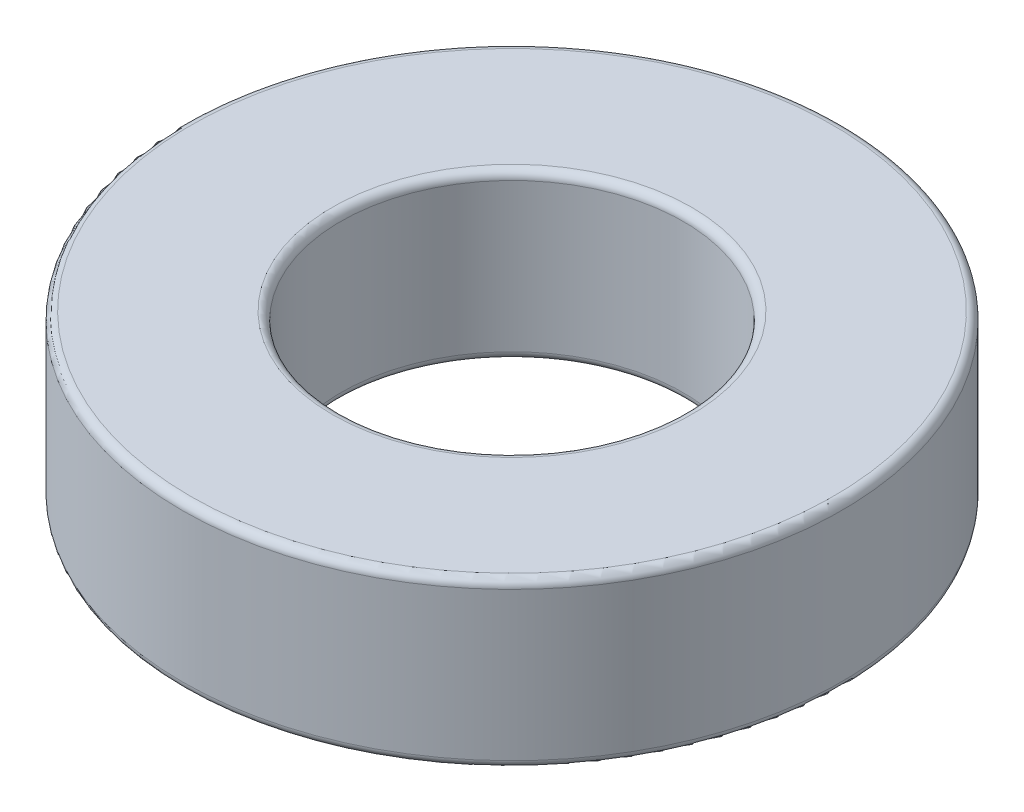
ISO-10303-21;
HEADER;
FILE_DESCRIPTION(('STEP AP214'),'2;1');
FILE_NAME('part.step','',(''),(''),'','','');
FILE_SCHEMA(('AUTOMOTIVE_DESIGN { 1 0 10303 214 1 1 1 1 }'));
ENDSEC;
DATA;
#1=APPLICATION_CONTEXT('core data for automotive mechanical design processes');
#2=APPLICATION_PROTOCOL_DEFINITION('international standard','automotive_design',2000,#1);
#3=PRODUCT_CONTEXT('',#1,'mechanical');
#4=PRODUCT('Part','Part','',(#3));
#5=PRODUCT_RELATED_PRODUCT_CATEGORY('part','',(#4));
#6=PRODUCT_DEFINITION_FORMATION('','',#4);
#7=PRODUCT_DEFINITION_CONTEXT('part definition',#1,'design');
#8=PRODUCT_DEFINITION('design','',#6,#7);
#9=PRODUCT_DEFINITION_SHAPE('','',#8);
#10=(LENGTH_UNIT() NAMED_UNIT(*) SI_UNIT(.MILLI.,.METRE.));
#11=(NAMED_UNIT(*) PLANE_ANGLE_UNIT() SI_UNIT($,.RADIAN.));
#12=(NAMED_UNIT(*) SI_UNIT($,.STERADIAN.) SOLID_ANGLE_UNIT());
#13=UNCERTAINTY_MEASURE_WITH_UNIT(LENGTH_MEASURE(1.E-05),#10,'distance_accuracy_value','');
#14=(GEOMETRIC_REPRESENTATION_CONTEXT(3) GLOBAL_UNCERTAINTY_ASSIGNED_CONTEXT((#13)) GLOBAL_UNIT_ASSIGNED_CONTEXT((#10,
#11,#12)) REPRESENTATION_CONTEXT('',''));
#15=CARTESIAN_POINT('',(0.,0.,0.));
#16=DIRECTION('',(0.,0.,1.));
#17=DIRECTION('',(1.,0.,0.));
#18=AXIS2_PLACEMENT_3D('',#15,#16,#17);
#19=CARTESIAN_POINT('',(0.,3.175,0.));
#20=DIRECTION('',(0.,1.,0.));
#21=DIRECTION('',(0.,0.,1.));
#22=AXIS2_PLACEMENT_3D('',#19,#20,#21);
#23=PLANE('',#22);
#24=CARTESIAN_POINT('',(0.,3.175,0.));
#25=DIRECTION('',(0.,1.,0.));
#26=DIRECTION('',(0.,0.,1.));
#27=AXIS2_PLACEMENT_3D('',#24,#25,#26);
#28=CIRCLE('',#27,3.46075);
#29=CARTESIAN_POINT('',(0.,3.175,3.46075));
#30=VERTEX_POINT('',#29);
#31=EDGE_CURVE('E10',#30,#30,#28,.F.);
#32=ORIENTED_EDGE('',*,*,#31,.T.);
#33=EDGE_LOOP('',(#32));
#34=FACE_BOUND('',#33,.T.);
#35=CARTESIAN_POINT('',(0.,3.175,0.));
#36=DIRECTION('',(0.,1.,0.));
#37=DIRECTION('',(0.,0.,1.));
#38=AXIS2_PLACEMENT_3D('',#35,#36,#37);
#39=CIRCLE('',#38,6.19125);
#40=CARTESIAN_POINT('',(0.,3.175,6.19125));
#41=VERTEX_POINT('',#40);
#42=EDGE_CURVE('E42',#41,#41,#39,.T.);
#43=ORIENTED_EDGE('',*,*,#42,.T.);
#44=EDGE_LOOP('',(#43));
#45=FACE_BOUND('',#44,.T.);
#46=ADVANCED_FACE('F40',(#34,#45),#23,.T.);
#47=CARTESIAN_POINT('',(0.,0.,0.));
#48=DIRECTION('',(0.,1.,0.));
#49=DIRECTION('',(0.,0.,1.));
#50=AXIS2_PLACEMENT_3D('',#47,#48,#49);
#51=PLANE('',#50);
#52=CARTESIAN_POINT('',(0.,0.,0.));
#53=DIRECTION('',(0.,1.,0.));
#54=DIRECTION('',(0.,0.,1.));
#55=AXIS2_PLACEMENT_3D('',#52,#53,#54);
#56=CIRCLE('',#55,3.46075);
#57=CARTESIAN_POINT('',(0.,0.,3.46075));
#58=VERTEX_POINT('',#57);
#59=EDGE_CURVE('E63',#58,#58,#56,.T.);
#60=ORIENTED_EDGE('',*,*,#59,.T.);
#61=EDGE_LOOP('',(#60));
#62=FACE_BOUND('',#61,.T.);
#63=CARTESIAN_POINT('',(0.,0.,0.));
#64=DIRECTION('',(0.,1.,0.));
#65=DIRECTION('',(0.,0.,1.));
#66=AXIS2_PLACEMENT_3D('',#63,#64,#65);
#67=CIRCLE('',#66,6.19125);
#68=CARTESIAN_POINT('',(0.,0.,6.19125));
#69=VERTEX_POINT('',#68);
#70=EDGE_CURVE('E67',#69,#69,#67,.F.);
#71=ORIENTED_EDGE('',*,*,#70,.T.);
#72=EDGE_LOOP('',(#71));
#73=FACE_BOUND('',#72,.T.);
#74=ADVANCED_FACE('F66',(#62,#73),#51,.F.);
#75=CARTESIAN_POINT('',(0.,3.175,0.));
#76=DIRECTION('',(0.,-1.,0.));
#77=DIRECTION('',(0.,0.,-1.));
#78=AXIS2_PLACEMENT_3D('',#75,#76,#77);
#79=CYLINDRICAL_SURFACE('',#78,6.35);
#80=CARTESIAN_POINT('',(0.,0.15875,0.));
#81=DIRECTION('',(0.,1.,0.));
#82=DIRECTION('',(0.,0.,1.));
#83=AXIS2_PLACEMENT_3D('',#80,#81,#82);
#84=CIRCLE('',#83,6.35);
#85=CARTESIAN_POINT('',(0.,0.15875,6.35));
#86=VERTEX_POINT('',#85);
#87=EDGE_CURVE('E48',#86,#86,#84,.T.);
#88=ORIENTED_EDGE('',*,*,#87,.T.);
#89=EDGE_LOOP('',(#88));
#90=FACE_BOUND('',#89,.T.);
#91=CARTESIAN_POINT('',(0.,3.01625,0.));
#92=DIRECTION('',(0.,1.,0.));
#93=DIRECTION('',(0.,0.,1.));
#94=AXIS2_PLACEMENT_3D('',#91,#92,#93);
#95=CIRCLE('',#94,6.35);
#96=CARTESIAN_POINT('',(0.,3.01625,6.35));
#97=VERTEX_POINT('',#96);
#98=EDGE_CURVE('E55',#97,#97,#95,.F.);
#99=ORIENTED_EDGE('',*,*,#98,.T.);
#100=EDGE_LOOP('',(#99));
#101=FACE_BOUND('',#100,.T.);
#102=ADVANCED_FACE('F76',(#90,#101),#79,.T.);
#103=CARTESIAN_POINT('',(0.,3.175,0.));
#104=DIRECTION('',(0.,-1.,0.));
#105=DIRECTION('',(0.,0.,-1.));
#106=AXIS2_PLACEMENT_3D('',#103,#104,#105);
#107=CYLINDRICAL_SURFACE('',#106,3.302);
#108=CARTESIAN_POINT('',(0.,0.15875,0.));
#109=DIRECTION('',(0.,1.,0.));
#110=DIRECTION('',(0.,0.,1.));
#111=AXIS2_PLACEMENT_3D('',#108,#109,#110);
#112=CIRCLE('',#111,3.302);
#113=CARTESIAN_POINT('',(0.,0.15875,3.302));
#114=VERTEX_POINT('',#113);
#115=EDGE_CURVE('E60',#114,#114,#112,.F.);
#116=ORIENTED_EDGE('',*,*,#115,.T.);
#117=EDGE_LOOP('',(#116));
#118=FACE_BOUND('',#117,.T.);
#119=CARTESIAN_POINT('',(0.,3.01625,0.));
#120=DIRECTION('',(0.,1.,0.));
#121=DIRECTION('',(0.,0.,1.));
#122=AXIS2_PLACEMENT_3D('',#119,#120,#121);
#123=CIRCLE('',#122,3.302);
#124=CARTESIAN_POINT('',(0.,3.01625,3.302));
#125=VERTEX_POINT('',#124);
#126=EDGE_CURVE('E58',#125,#125,#123,.T.);
#127=ORIENTED_EDGE('',*,*,#126,.T.);
#128=EDGE_LOOP('',(#127));
#129=FACE_BOUND('',#128,.T.);
#130=ADVANCED_FACE('F83',(#118,#129),#107,.F.);
#131=CARTESIAN_POINT('',(0.,0.15875,0.));
#132=DIRECTION('',(0.,1.,0.));
#133=DIRECTION('',(0.,0.,1.));
#134=AXIS2_PLACEMENT_3D('',#131,#132,#133);
#135=TOROIDAL_SURFACE('',#134,3.46075,0.15875);
#136=ORIENTED_EDGE('',*,*,#115,.F.);
#137=EDGE_LOOP('',(#136));
#138=FACE_BOUND('',#137,.T.);
#139=ORIENTED_EDGE('',*,*,#59,.F.);
#140=EDGE_LOOP('',(#139));
#141=FACE_BOUND('',#140,.T.);
#142=ADVANCED_FACE('F77',(#138,#141),#135,.T.);
#143=CARTESIAN_POINT('',(0.,0.15875,0.));
#144=DIRECTION('',(0.,1.,0.));
#145=DIRECTION('',(0.,0.,1.));
#146=AXIS2_PLACEMENT_3D('',#143,#144,#145);
#147=TOROIDAL_SURFACE('',#146,6.19125,0.15875);
#148=ORIENTED_EDGE('',*,*,#70,.F.);
#149=EDGE_LOOP('',(#148));
#150=FACE_BOUND('',#149,.T.);
#151=ORIENTED_EDGE('',*,*,#87,.F.);
#152=EDGE_LOOP('',(#151));
#153=FACE_BOUND('',#152,.T.);
#154=ADVANCED_FACE('F75',(#150,#153),#147,.T.);
#155=CARTESIAN_POINT('',(0.,3.01625,0.));
#156=DIRECTION('',(0.,1.,0.));
#157=DIRECTION('',(0.,0.,1.));
#158=AXIS2_PLACEMENT_3D('',#155,#156,#157);
#159=TOROIDAL_SURFACE('',#158,3.46075,0.15875);
#160=ORIENTED_EDGE('',*,*,#31,.F.);
#161=EDGE_LOOP('',(#160));
#162=FACE_BOUND('',#161,.T.);
#163=ORIENTED_EDGE('',*,*,#126,.F.);
#164=EDGE_LOOP('',(#163));
#165=FACE_BOUND('',#164,.T.);
#166=ADVANCED_FACE('F73',(#162,#165),#159,.T.);
#167=CARTESIAN_POINT('',(0.,3.01625,0.));
#168=DIRECTION('',(0.,1.,0.));
#169=DIRECTION('',(0.,0.,1.));
#170=AXIS2_PLACEMENT_3D('',#167,#168,#169);
#171=TOROIDAL_SURFACE('',#170,6.19125,0.15875);
#172=ORIENTED_EDGE('',*,*,#98,.F.);
#173=EDGE_LOOP('',(#172));
#174=FACE_BOUND('',#173,.T.);
#175=ORIENTED_EDGE('',*,*,#42,.F.);
#176=EDGE_LOOP('',(#175));
#177=FACE_BOUND('',#176,.T.);
#178=ADVANCED_FACE('F39',(#174,#177),#171,.T.);
#179=CLOSED_SHELL('',(#46,#74,#102,#130,#142,#154,#166,#178));
#180=MANIFOLD_SOLID_BREP('B2',#179);
#181=ADVANCED_BREP_SHAPE_REPRESENTATION('',(#18,#180),#14);
#182=SHAPE_DEFINITION_REPRESENTATION(#9,#181);
ENDSEC;
END-ISO-10303-21;
